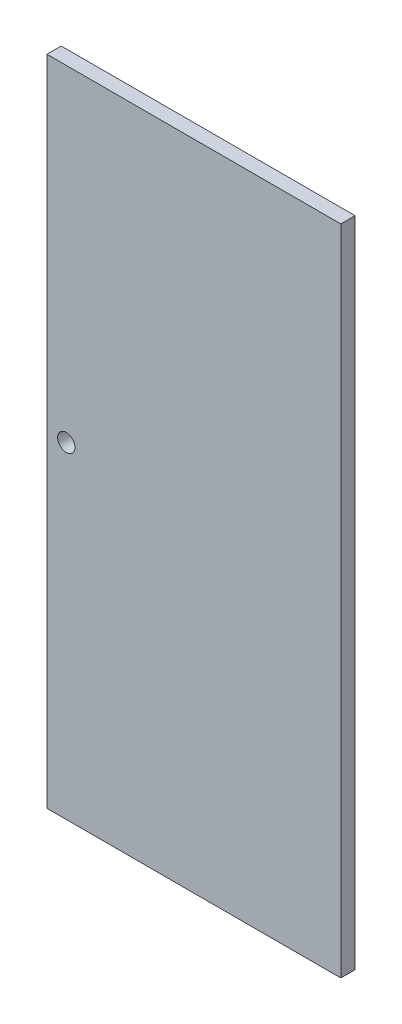
ISO-10303-21;
HEADER;
FILE_DESCRIPTION(('STEP AP214'),'2;1');
FILE_NAME('part.step','',(''),(''),'','','');
FILE_SCHEMA(('AUTOMOTIVE_DESIGN { 1 0 10303 214 1 1 1 1 }'));
ENDSEC;
DATA;
#1=APPLICATION_CONTEXT('core data for automotive mechanical design processes');
#2=APPLICATION_PROTOCOL_DEFINITION('international standard','automotive_design',2000,#1);
#3=PRODUCT_CONTEXT('',#1,'mechanical');
#4=PRODUCT('Part','Part','',(#3));
#5=PRODUCT_RELATED_PRODUCT_CATEGORY('part','',(#4));
#6=PRODUCT_DEFINITION_FORMATION('','',#4);
#7=PRODUCT_DEFINITION_CONTEXT('part definition',#1,'design');
#8=PRODUCT_DEFINITION('design','',#6,#7);
#9=PRODUCT_DEFINITION_SHAPE('','',#8);
#10=(LENGTH_UNIT() NAMED_UNIT(*) SI_UNIT(.MILLI.,.METRE.));
#11=(NAMED_UNIT(*) PLANE_ANGLE_UNIT() SI_UNIT($,.RADIAN.));
#12=(NAMED_UNIT(*) SI_UNIT($,.STERADIAN.) SOLID_ANGLE_UNIT());
#13=UNCERTAINTY_MEASURE_WITH_UNIT(LENGTH_MEASURE(1.E-05),#10,'distance_accuracy_value','');
#14=(GEOMETRIC_REPRESENTATION_CONTEXT(3) GLOBAL_UNCERTAINTY_ASSIGNED_CONTEXT((#13)) GLOBAL_UNIT_ASSIGNED_CONTEXT((#10,
#11,#12)) REPRESENTATION_CONTEXT('',''));
#15=CARTESIAN_POINT('',(0.,0.,0.));
#16=DIRECTION('',(0.,0.,1.));
#17=DIRECTION('',(1.,0.,0.));
#18=AXIS2_PLACEMENT_3D('',#15,#16,#17);
#19=CARTESIAN_POINT('',(658.971038615179,2.39287616511286,44.45));
#20=DIRECTION('',(1.,0.,0.));
#21=DIRECTION('',(0.,0.,-1.));
#22=AXIS2_PLACEMENT_3D('',#19,#20,#21);
#23=PLANE('',#22);
#24=DIRECTION('',(0.,-1.,0.));
#25=VECTOR('',#24,1.);
#26=CARTESIAN_POINT('',(658.971038615179,2.39287616511286,0.));
#27=LINE('',#26,#25);
#28=CARTESIAN_POINT('',(658.971038615179,2034.39287616511,0.));
#29=VERTEX_POINT('',#28);
#30=CARTESIAN_POINT('',(658.971038615179,2.39287616511286,0.));
#31=VERTEX_POINT('',#30);
#32=EDGE_CURVE('E97',#29,#31,#27,.T.);
#33=ORIENTED_EDGE('',*,*,#32,.T.);
#34=DIRECTION('',(0.,0.,-1.));
#35=VECTOR('',#34,1.);
#36=CARTESIAN_POINT('',(658.971038615179,2.39287616511286,44.45));
#37=LINE('',#36,#35);
#38=CARTESIAN_POINT('',(658.971038615179,2.39287616511286,44.45));
#39=VERTEX_POINT('',#38);
#40=EDGE_CURVE('E11',#39,#31,#37,.T.);
#41=ORIENTED_EDGE('',*,*,#40,.F.);
#42=DIRECTION('',(0.,-1.,0.));
#43=VECTOR('',#42,1.);
#44=CARTESIAN_POINT('',(658.971038615179,2.39287616511286,44.45));
#45=LINE('',#44,#43);
#46=CARTESIAN_POINT('',(658.971038615179,2034.39287616511,44.45));
#47=VERTEX_POINT('',#46);
#48=EDGE_CURVE('E85',#47,#39,#45,.T.);
#49=ORIENTED_EDGE('',*,*,#48,.F.);
#50=DIRECTION('',(0.,0.,-1.));
#51=VECTOR('',#50,1.);
#52=CARTESIAN_POINT('',(658.971038615179,2034.39287616511,44.45));
#53=LINE('',#52,#51);
#54=EDGE_CURVE('E93',#47,#29,#53,.T.);
#55=ORIENTED_EDGE('',*,*,#54,.T.);
#56=EDGE_LOOP('',(#33,#41,#49,#55));
#57=FACE_BOUND('',#56,.T.);
#58=ADVANCED_FACE('F34',(#57),#23,.F.);
#59=CARTESIAN_POINT('',(658.971038615179,2.39287616511286,44.45));
#60=DIRECTION('',(0.,1.,0.));
#61=DIRECTION('',(0.,0.,1.));
#62=AXIS2_PLACEMENT_3D('',#59,#60,#61);
#63=PLANE('',#62);
#64=DIRECTION('',(1.,0.,0.));
#65=VECTOR('',#64,1.);
#66=CARTESIAN_POINT('',(658.971038615179,2.39287616511286,0.));
#67=LINE('',#66,#65);
#68=CARTESIAN_POINT('',(1573.37103861518,2.39287616511286,0.));
#69=VERTEX_POINT('',#68);
#70=EDGE_CURVE('E89',#31,#69,#67,.T.);
#71=ORIENTED_EDGE('',*,*,#70,.T.);
#72=DIRECTION('',(0.,0.,-1.));
#73=VECTOR('',#72,1.);
#74=CARTESIAN_POINT('',(1573.37103861518,2.39287616511286,44.45));
#75=LINE('',#74,#73);
#76=CARTESIAN_POINT('',(1573.37103861518,2.39287616511286,44.45));
#77=VERTEX_POINT('',#76);
#78=EDGE_CURVE('E42',#77,#69,#75,.T.);
#79=ORIENTED_EDGE('',*,*,#78,.F.);
#80=DIRECTION('',(1.,0.,0.));
#81=VECTOR('',#80,1.);
#82=CARTESIAN_POINT('',(658.971038615179,2.39287616511286,44.45));
#83=LINE('',#82,#81);
#84=EDGE_CURVE('E80',#39,#77,#83,.T.);
#85=ORIENTED_EDGE('',*,*,#84,.F.);
#86=ORIENTED_EDGE('',*,*,#40,.T.);
#87=EDGE_LOOP('',(#71,#79,#85,#86));
#88=FACE_BOUND('',#87,.T.);
#89=ADVANCED_FACE('F88',(#88),#63,.F.);
#90=CARTESIAN_POINT('',(1573.37103861518,2.39287616511286,44.45));
#91=DIRECTION('',(-1.,0.,0.));
#92=DIRECTION('',(0.,0.,1.));
#93=AXIS2_PLACEMENT_3D('',#90,#91,#92);
#94=PLANE('',#93);
#95=DIRECTION('',(0.,1.,0.));
#96=VECTOR('',#95,1.);
#97=CARTESIAN_POINT('',(1573.37103861518,2.39287616511286,0.));
#98=LINE('',#97,#96);
#99=CARTESIAN_POINT('',(1573.37103861518,2034.39287616511,0.));
#100=VERTEX_POINT('',#99);
#101=EDGE_CURVE('E67',#69,#100,#98,.T.);
#102=ORIENTED_EDGE('',*,*,#101,.T.);
#103=DIRECTION('',(0.,0.,-1.));
#104=VECTOR('',#103,1.);
#105=CARTESIAN_POINT('',(1573.37103861518,2034.39287616511,44.45));
#106=LINE('',#105,#104);
#107=CARTESIAN_POINT('',(1573.37103861518,2034.39287616511,44.45));
#108=VERTEX_POINT('',#107);
#109=EDGE_CURVE('E90',#108,#100,#106,.T.);
#110=ORIENTED_EDGE('',*,*,#109,.F.);
#111=DIRECTION('',(0.,1.,0.));
#112=VECTOR('',#111,1.);
#113=CARTESIAN_POINT('',(1573.37103861518,2.39287616511286,44.45));
#114=LINE('',#113,#112);
#115=EDGE_CURVE('E83',#77,#108,#114,.T.);
#116=ORIENTED_EDGE('',*,*,#115,.F.);
#117=ORIENTED_EDGE('',*,*,#78,.T.);
#118=EDGE_LOOP('',(#102,#110,#116,#117));
#119=FACE_BOUND('',#118,.T.);
#120=ADVANCED_FACE('F91',(#119),#94,.F.);
#121=CARTESIAN_POINT('',(658.971038615179,2034.39287616511,44.45));
#122=DIRECTION('',(0.,-1.,0.));
#123=DIRECTION('',(0.,0.,-1.));
#124=AXIS2_PLACEMENT_3D('',#121,#122,#123);
#125=PLANE('',#124);
#126=DIRECTION('',(-1.,0.,0.));
#127=VECTOR('',#126,1.);
#128=CARTESIAN_POINT('',(658.971038615179,2034.39287616511,0.));
#129=LINE('',#128,#127);
#130=EDGE_CURVE('E73',#100,#29,#129,.T.);
#131=ORIENTED_EDGE('',*,*,#130,.T.);
#132=ORIENTED_EDGE('',*,*,#54,.F.);
#133=DIRECTION('',(-1.,0.,0.));
#134=VECTOR('',#133,1.);
#135=CARTESIAN_POINT('',(658.971038615179,2034.39287616511,44.45));
#136=LINE('',#135,#134);
#137=EDGE_CURVE('E50',#108,#47,#136,.T.);
#138=ORIENTED_EDGE('',*,*,#137,.F.);
#139=ORIENTED_EDGE('',*,*,#109,.T.);
#140=EDGE_LOOP('',(#131,#132,#138,#139));
#141=FACE_BOUND('',#140,.T.);
#142=ADVANCED_FACE('F105',(#141),#125,.F.);
#143=CARTESIAN_POINT('',(0.,0.,44.45));
#144=DIRECTION('',(0.,0.,-1.));
#145=DIRECTION('',(-1.,0.,0.));
#146=AXIS2_PLACEMENT_3D('',#143,#144,#145);
#147=PLANE('',#146);
#148=CARTESIAN_POINT('',(719.296038615179,1018.39287616511,44.45));
#149=DIRECTION('',(0.,0.,1.));
#150=DIRECTION('',(1.,0.,0.));
#151=AXIS2_PLACEMENT_3D('',#148,#149,#150);
#152=CIRCLE('',#151,26.9874999999999);
#153=CARTESIAN_POINT('',(746.283538615179,1018.39287616511,44.45));
#154=VERTEX_POINT('',#153);
#155=EDGE_CURVE('E111',#154,#154,#152,.T.);
#156=ORIENTED_EDGE('',*,*,#155,.F.);
#157=EDGE_LOOP('',(#156));
#158=FACE_BOUND('',#157,.T.);
#159=ORIENTED_EDGE('',*,*,#48,.T.);
#160=ORIENTED_EDGE('',*,*,#84,.T.);
#161=ORIENTED_EDGE('',*,*,#115,.T.);
#162=ORIENTED_EDGE('',*,*,#137,.T.);
#163=EDGE_LOOP('',(#159,#160,#161,#162));
#164=FACE_BOUND('',#163,.T.);
#165=ADVANCED_FACE('F81',(#158,#164),#147,.F.);
#166=CARTESIAN_POINT('',(0.,0.,0.));
#167=DIRECTION('',(0.,0.,-1.));
#168=DIRECTION('',(-1.,0.,0.));
#169=AXIS2_PLACEMENT_3D('',#166,#167,#168);
#170=PLANE('',#169);
#171=CARTESIAN_POINT('',(719.296038615179,1018.39287616511,0.));
#172=DIRECTION('',(0.,0.,1.));
#173=DIRECTION('',(1.,0.,0.));
#174=AXIS2_PLACEMENT_3D('',#171,#172,#173);
#175=CIRCLE('',#174,26.9874999999999);
#176=CARTESIAN_POINT('',(746.283538615179,1018.39287616511,0.));
#177=VERTEX_POINT('',#176);
#178=EDGE_CURVE('E100',#177,#177,#175,.T.);
#179=ORIENTED_EDGE('',*,*,#178,.T.);
#180=EDGE_LOOP('',(#179));
#181=FACE_BOUND('',#180,.T.);
#182=ORIENTED_EDGE('',*,*,#32,.F.);
#183=ORIENTED_EDGE('',*,*,#130,.F.);
#184=ORIENTED_EDGE('',*,*,#101,.F.);
#185=ORIENTED_EDGE('',*,*,#70,.F.);
#186=EDGE_LOOP('',(#182,#183,#184,#185));
#187=FACE_BOUND('',#186,.T.);
#188=ADVANCED_FACE('F108',(#181,#187),#170,.T.);
#189=CARTESIAN_POINT('',(719.296038615179,1018.39287616511,0.));
#190=DIRECTION('',(0.,0.,1.));
#191=DIRECTION('',(1.,0.,0.));
#192=AXIS2_PLACEMENT_3D('',#189,#190,#191);
#193=CYLINDRICAL_SURFACE('',#192,26.9874999999999);
#194=ORIENTED_EDGE('',*,*,#178,.F.);
#195=EDGE_LOOP('',(#194));
#196=FACE_BOUND('',#195,.T.);
#197=ORIENTED_EDGE('',*,*,#155,.T.);
#198=EDGE_LOOP('',(#197));
#199=FACE_BOUND('',#198,.T.);
#200=ADVANCED_FACE('F118',(#196,#199),#193,.F.);
#201=CLOSED_SHELL('',(#58,#89,#120,#142,#165,#188,#200));
#202=MANIFOLD_SOLID_BREP('B2',#201);
#203=ADVANCED_BREP_SHAPE_REPRESENTATION('',(#18,#202),#14);
#204=SHAPE_DEFINITION_REPRESENTATION(#9,#203);
ENDSEC;
END-ISO-10303-21;
